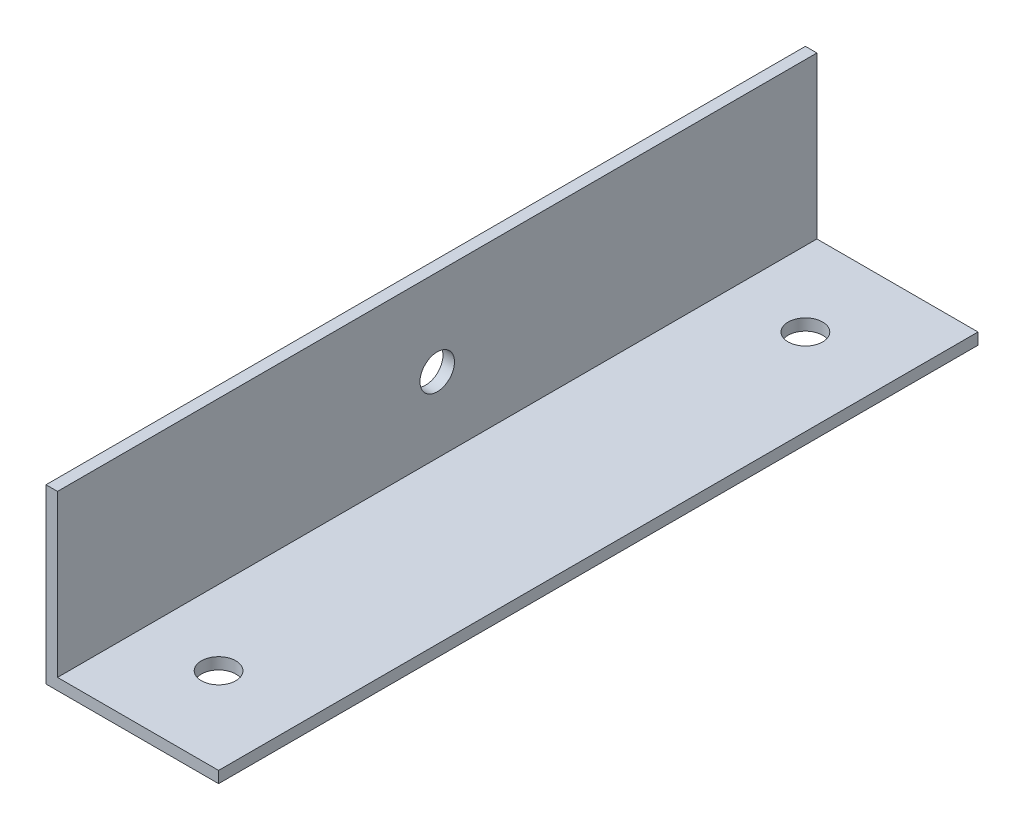
ISO-10303-21;
HEADER;
FILE_DESCRIPTION(('STEP AP214'),'2;1');
FILE_NAME('part.step','',(''),(''),'','','');
FILE_SCHEMA(('AUTOMOTIVE_DESIGN { 1 0 10303 214 1 1 1 1 }'));
ENDSEC;
DATA;
#1=APPLICATION_CONTEXT('core data for automotive mechanical design processes');
#2=APPLICATION_PROTOCOL_DEFINITION('international standard','automotive_design',2000,#1);
#3=PRODUCT_CONTEXT('',#1,'mechanical');
#4=PRODUCT('Part','Part','',(#3));
#5=PRODUCT_RELATED_PRODUCT_CATEGORY('part','',(#4));
#6=PRODUCT_DEFINITION_FORMATION('','',#4);
#7=PRODUCT_DEFINITION_CONTEXT('part definition',#1,'design');
#8=PRODUCT_DEFINITION('design','',#6,#7);
#9=PRODUCT_DEFINITION_SHAPE('','',#8);
#10=(LENGTH_UNIT() NAMED_UNIT(*) SI_UNIT(.MILLI.,.METRE.));
#11=(NAMED_UNIT(*) PLANE_ANGLE_UNIT() SI_UNIT($,.RADIAN.));
#12=(NAMED_UNIT(*) SI_UNIT($,.STERADIAN.) SOLID_ANGLE_UNIT());
#13=UNCERTAINTY_MEASURE_WITH_UNIT(LENGTH_MEASURE(1.E-05),#10,'distance_accuracy_value','');
#14=(GEOMETRIC_REPRESENTATION_CONTEXT(3) GLOBAL_UNCERTAINTY_ASSIGNED_CONTEXT((#13)) GLOBAL_UNIT_ASSIGNED_CONTEXT((#10,
#11,#12)) REPRESENTATION_CONTEXT('',''));
#15=CARTESIAN_POINT('',(0.,0.,0.));
#16=DIRECTION('',(0.,0.,1.));
#17=DIRECTION('',(1.,0.,0.));
#18=AXIS2_PLACEMENT_3D('',#15,#16,#17);
#19=CARTESIAN_POINT('',(-4.46145577395577,0.,66.));
#20=DIRECTION('',(1.,0.,0.));
#21=DIRECTION('',(0.,1.,0.));
#22=AXIS2_PLACEMENT_3D('',#19,#20,#21);
#23=PLANE('',#22);
#24=CARTESIAN_POINT('',(-4.46145577395577,-1.14669421487603,33.));
#25=DIRECTION('',(1.,0.,0.));
#26=DIRECTION('',(0.,1.,0.));
#27=AXIS2_PLACEMENT_3D('',#24,#25,#26);
#28=CIRCLE('',#27,1.5);
#29=CARTESIAN_POINT('',(-4.46145577395577,0.353305785123971,33.));
#30=VERTEX_POINT('',#29);
#31=EDGE_CURVE('E149',#30,#30,#28,.T.);
#32=ORIENTED_EDGE('',*,*,#31,.F.);
#33=EDGE_LOOP('',(#32));
#34=FACE_BOUND('',#33,.T.);
#35=DIRECTION('',(0.,-1.,0.));
#36=VECTOR('',#35,1.);
#37=CARTESIAN_POINT('',(-4.46145577395577,0.,0.));
#38=LINE('',#37,#36);
#39=CARTESIAN_POINT('',(-4.46145577395577,6.35330578512397,0.));
#40=VERTEX_POINT('',#39);
#41=CARTESIAN_POINT('',(-4.46145577395577,-7.64669421487603,0.));
#42=VERTEX_POINT('',#41);
#43=EDGE_CURVE('E118',#40,#42,#38,.T.);
#44=ORIENTED_EDGE('',*,*,#43,.F.);
#45=DIRECTION('',(0.,0.,-1.));
#46=VECTOR('',#45,1.);
#47=CARTESIAN_POINT('',(-4.46145577395577,6.35330578512397,66.));
#48=LINE('',#47,#46);
#49=CARTESIAN_POINT('',(-4.46145577395577,6.35330578512397,66.));
#50=VERTEX_POINT('',#49);
#51=EDGE_CURVE('E11',#50,#40,#48,.T.);
#52=ORIENTED_EDGE('',*,*,#51,.F.);
#53=DIRECTION('',(0.,-1.,0.));
#54=VECTOR('',#53,1.);
#55=CARTESIAN_POINT('',(-4.46145577395577,0.,66.));
#56=LINE('',#55,#54);
#57=CARTESIAN_POINT('',(-4.46145577395577,-7.64669421487603,66.));
#58=VERTEX_POINT('',#57);
#59=EDGE_CURVE('E131',#50,#58,#56,.T.);
#60=ORIENTED_EDGE('',*,*,#59,.T.);
#61=DIRECTION('',(0.,0.,-1.));
#62=VECTOR('',#61,1.);
#63=CARTESIAN_POINT('',(-4.46145577395577,-7.64669421487603,66.));
#64=LINE('',#63,#62);
#65=EDGE_CURVE('E80',#58,#42,#64,.T.);
#66=ORIENTED_EDGE('',*,*,#65,.T.);
#67=EDGE_LOOP('',(#44,#52,#60,#66));
#68=FACE_BOUND('',#67,.T.);
#69=ADVANCED_FACE('F35',(#34,#68),#23,.T.);
#70=CARTESIAN_POINT('',(0.,6.35330578512397,66.));
#71=DIRECTION('',(0.,1.,0.));
#72=DIRECTION('',(-1.,0.,0.));
#73=AXIS2_PLACEMENT_3D('',#70,#71,#72);
#74=PLANE('',#73);
#75=DIRECTION('',(1.,0.,0.));
#76=VECTOR('',#75,1.);
#77=CARTESIAN_POINT('',(0.,6.35330578512397,0.));
#78=LINE('',#77,#76);
#79=CARTESIAN_POINT('',(-5.46145577395577,6.35330578512397,0.));
#80=VERTEX_POINT('',#79);
#81=EDGE_CURVE('E121',#80,#40,#78,.T.);
#82=ORIENTED_EDGE('',*,*,#81,.F.);
#83=DIRECTION('',(0.,0.,-1.));
#84=VECTOR('',#83,1.);
#85=CARTESIAN_POINT('',(-5.46145577395577,6.35330578512397,66.));
#86=LINE('',#85,#84);
#87=CARTESIAN_POINT('',(-5.46145577395577,6.35330578512397,66.));
#88=VERTEX_POINT('',#87);
#89=EDGE_CURVE('E44',#88,#80,#86,.T.);
#90=ORIENTED_EDGE('',*,*,#89,.F.);
#91=DIRECTION('',(1.,0.,0.));
#92=VECTOR('',#91,1.);
#93=CARTESIAN_POINT('',(0.,6.35330578512397,66.));
#94=LINE('',#93,#92);
#95=EDGE_CURVE('E144',#88,#50,#94,.T.);
#96=ORIENTED_EDGE('',*,*,#95,.T.);
#97=ORIENTED_EDGE('',*,*,#51,.T.);
#98=EDGE_LOOP('',(#82,#90,#96,#97));
#99=FACE_BOUND('',#98,.T.);
#100=ADVANCED_FACE('F143',(#99),#74,.T.);
#101=CARTESIAN_POINT('',(-5.46145577395577,0.,66.));
#102=DIRECTION('',(1.,0.,0.));
#103=DIRECTION('',(0.,0.,-1.));
#104=AXIS2_PLACEMENT_3D('',#101,#102,#103);
#105=PLANE('',#104);
#106=CARTESIAN_POINT('',(-5.46145577395577,-1.14669421487603,33.));
#107=DIRECTION('',(1.,0.,0.));
#108=DIRECTION('',(0.,0.,-1.));
#109=AXIS2_PLACEMENT_3D('',#106,#107,#108);
#110=CIRCLE('',#109,1.5);
#111=CARTESIAN_POINT('',(-5.46145577395577,-1.14669421487603,31.5));
#112=VERTEX_POINT('',#111);
#113=EDGE_CURVE('E38',#112,#112,#110,.T.);
#114=ORIENTED_EDGE('',*,*,#113,.T.);
#115=EDGE_LOOP('',(#114));
#116=FACE_BOUND('',#115,.T.);
#117=DIRECTION('',(0.,-1.,0.));
#118=VECTOR('',#117,1.);
#119=CARTESIAN_POINT('',(-5.46145577395577,0.,0.));
#120=LINE('',#119,#118);
#121=CARTESIAN_POINT('',(-5.46145577395577,-8.64669421487603,0.));
#122=VERTEX_POINT('',#121);
#123=EDGE_CURVE('E124',#80,#122,#120,.T.);
#124=ORIENTED_EDGE('',*,*,#123,.T.);
#125=DIRECTION('',(0.,0.,-1.));
#126=VECTOR('',#125,1.);
#127=CARTESIAN_POINT('',(-5.46145577395577,-8.64669421487603,66.));
#128=LINE('',#127,#126);
#129=CARTESIAN_POINT('',(-5.46145577395577,-8.64669421487603,66.));
#130=VERTEX_POINT('',#129);
#131=EDGE_CURVE('E111',#130,#122,#128,.T.);
#132=ORIENTED_EDGE('',*,*,#131,.F.);
#133=DIRECTION('',(0.,-1.,0.));
#134=VECTOR('',#133,1.);
#135=CARTESIAN_POINT('',(-5.46145577395577,0.,66.));
#136=LINE('',#135,#134);
#137=EDGE_CURVE('E98',#88,#130,#136,.T.);
#138=ORIENTED_EDGE('',*,*,#137,.F.);
#139=ORIENTED_EDGE('',*,*,#89,.T.);
#140=EDGE_LOOP('',(#124,#132,#138,#139));
#141=FACE_BOUND('',#140,.T.);
#142=ADVANCED_FACE('F137',(#116,#141),#105,.F.);
#143=CARTESIAN_POINT('',(0.,-8.64669421487603,66.));
#144=DIRECTION('',(0.,1.,0.));
#145=DIRECTION('',(0.,0.,1.));
#146=AXIS2_PLACEMENT_3D('',#143,#144,#145);
#147=PLANE('',#146);
#148=CARTESIAN_POINT('',(2.03854422604423,-8.64669421487603,58.5));
#149=DIRECTION('',(0.,1.,0.));
#150=DIRECTION('',(0.,0.,1.));
#151=AXIS2_PLACEMENT_3D('',#148,#149,#150);
#152=CIRCLE('',#151,1.5);
#153=CARTESIAN_POINT('',(2.03854422604423,-8.64669421487603,60.));
#154=VERTEX_POINT('',#153);
#155=EDGE_CURVE('E158',#154,#154,#152,.T.);
#156=ORIENTED_EDGE('',*,*,#155,.T.);
#157=EDGE_LOOP('',(#156));
#158=FACE_BOUND('',#157,.T.);
#159=CARTESIAN_POINT('',(2.03854422604423,-8.64669421487603,7.5));
#160=DIRECTION('',(0.,1.,0.));
#161=DIRECTION('',(0.,0.,1.));
#162=AXIS2_PLACEMENT_3D('',#159,#160,#161);
#163=CIRCLE('',#162,1.5);
#164=CARTESIAN_POINT('',(2.03854422604423,-8.64669421487603,9.));
#165=VERTEX_POINT('',#164);
#166=EDGE_CURVE('E152',#165,#165,#163,.T.);
#167=ORIENTED_EDGE('',*,*,#166,.T.);
#168=EDGE_LOOP('',(#167));
#169=FACE_BOUND('',#168,.T.);
#170=DIRECTION('',(1.,0.,0.));
#171=VECTOR('',#170,1.);
#172=CARTESIAN_POINT('',(0.,-8.64669421487603,0.));
#173=LINE('',#172,#171);
#174=CARTESIAN_POINT('',(9.53854422604423,-8.64669421487603,0.));
#175=VERTEX_POINT('',#174);
#176=EDGE_CURVE('E107',#122,#175,#173,.T.);
#177=ORIENTED_EDGE('',*,*,#176,.T.);
#178=DIRECTION('',(0.,0.,-1.));
#179=VECTOR('',#178,1.);
#180=CARTESIAN_POINT('',(9.53854422604423,-8.64669421487603,66.));
#181=LINE('',#180,#179);
#182=CARTESIAN_POINT('',(9.53854422604423,-8.64669421487603,66.));
#183=VERTEX_POINT('',#182);
#184=EDGE_CURVE('E104',#183,#175,#181,.T.);
#185=ORIENTED_EDGE('',*,*,#184,.F.);
#186=DIRECTION('',(1.,0.,0.));
#187=VECTOR('',#186,1.);
#188=CARTESIAN_POINT('',(0.,-8.64669421487603,66.));
#189=LINE('',#188,#187);
#190=EDGE_CURVE('E91',#130,#183,#189,.T.);
#191=ORIENTED_EDGE('',*,*,#190,.F.);
#192=ORIENTED_EDGE('',*,*,#131,.T.);
#193=EDGE_LOOP('',(#177,#185,#191,#192));
#194=FACE_BOUND('',#193,.T.);
#195=ADVANCED_FACE('F105',(#158,#169,#194),#147,.F.);
#196=CARTESIAN_POINT('',(9.53854422604423,0.,66.));
#197=DIRECTION('',(1.,0.,0.));
#198=DIRECTION('',(0.,1.,0.));
#199=AXIS2_PLACEMENT_3D('',#196,#197,#198);
#200=PLANE('',#199);
#201=DIRECTION('',(0.,-1.,0.));
#202=VECTOR('',#201,1.);
#203=CARTESIAN_POINT('',(9.53854422604423,0.,0.));
#204=LINE('',#203,#202);
#205=CARTESIAN_POINT('',(9.53854422604423,-7.64669421487603,0.));
#206=VERTEX_POINT('',#205);
#207=EDGE_CURVE('E127',#206,#175,#204,.T.);
#208=ORIENTED_EDGE('',*,*,#207,.F.);
#209=DIRECTION('',(0.,0.,-1.));
#210=VECTOR('',#209,1.);
#211=CARTESIAN_POINT('',(9.53854422604423,-7.64669421487603,66.));
#212=LINE('',#211,#210);
#213=CARTESIAN_POINT('',(9.53854422604423,-7.64669421487603,66.));
#214=VERTEX_POINT('',#213);
#215=EDGE_CURVE('E73',#214,#206,#212,.T.);
#216=ORIENTED_EDGE('',*,*,#215,.F.);
#217=DIRECTION('',(0.,-1.,0.));
#218=VECTOR('',#217,1.);
#219=CARTESIAN_POINT('',(9.53854422604423,0.,66.));
#220=LINE('',#219,#218);
#221=EDGE_CURVE('E95',#214,#183,#220,.T.);
#222=ORIENTED_EDGE('',*,*,#221,.T.);
#223=ORIENTED_EDGE('',*,*,#184,.T.);
#224=EDGE_LOOP('',(#208,#216,#222,#223));
#225=FACE_BOUND('',#224,.T.);
#226=ADVANCED_FACE('F113',(#225),#200,.T.);
#227=CARTESIAN_POINT('',(0.,-7.64669421487603,66.));
#228=DIRECTION('',(0.,-1.,0.));
#229=DIRECTION('',(1.,0.,0.));
#230=AXIS2_PLACEMENT_3D('',#227,#228,#229);
#231=PLANE('',#230);
#232=CARTESIAN_POINT('',(2.03854422604423,-7.64669421487603,58.5));
#233=DIRECTION('',(0.,1.,0.));
#234=DIRECTION('',(-1.,0.,0.));
#235=AXIS2_PLACEMENT_3D('',#232,#233,#234);
#236=CIRCLE('',#235,1.5);
#237=CARTESIAN_POINT('',(0.538544226044231,-7.64669421487603,58.5));
#238=VERTEX_POINT('',#237);
#239=EDGE_CURVE('E161',#238,#238,#236,.T.);
#240=ORIENTED_EDGE('',*,*,#239,.F.);
#241=EDGE_LOOP('',(#240));
#242=FACE_BOUND('',#241,.T.);
#243=CARTESIAN_POINT('',(2.03854422604423,-7.64669421487603,7.5));
#244=DIRECTION('',(0.,1.,0.));
#245=DIRECTION('',(-1.,0.,0.));
#246=AXIS2_PLACEMENT_3D('',#243,#244,#245);
#247=CIRCLE('',#246,1.5);
#248=CARTESIAN_POINT('',(0.538544226044232,-7.64669421487603,7.5));
#249=VERTEX_POINT('',#248);
#250=EDGE_CURVE('E155',#249,#249,#247,.T.);
#251=ORIENTED_EDGE('',*,*,#250,.F.);
#252=EDGE_LOOP('',(#251));
#253=FACE_BOUND('',#252,.T.);
#254=DIRECTION('',(-1.,0.,0.));
#255=VECTOR('',#254,1.);
#256=CARTESIAN_POINT('',(0.,-7.64669421487603,0.));
#257=LINE('',#256,#255);
#258=EDGE_CURVE('E129',#206,#42,#257,.T.);
#259=ORIENTED_EDGE('',*,*,#258,.T.);
#260=ORIENTED_EDGE('',*,*,#65,.F.);
#261=DIRECTION('',(-1.,0.,0.));
#262=VECTOR('',#261,1.);
#263=CARTESIAN_POINT('',(0.,-7.64669421487603,66.));
#264=LINE('',#263,#262);
#265=EDGE_CURVE('E52',#214,#58,#264,.T.);
#266=ORIENTED_EDGE('',*,*,#265,.F.);
#267=ORIENTED_EDGE('',*,*,#215,.T.);
#268=EDGE_LOOP('',(#259,#260,#266,#267));
#269=FACE_BOUND('',#268,.T.);
#270=ADVANCED_FACE('F145',(#242,#253,#269),#231,.F.);
#271=CARTESIAN_POINT('',(0.,0.,66.));
#272=DIRECTION('',(0.,0.,1.));
#273=DIRECTION('',(1.,0.,0.));
#274=AXIS2_PLACEMENT_3D('',#271,#272,#273);
#275=PLANE('',#274);
#276=ORIENTED_EDGE('',*,*,#59,.F.);
#277=ORIENTED_EDGE('',*,*,#95,.F.);
#278=ORIENTED_EDGE('',*,*,#137,.T.);
#279=ORIENTED_EDGE('',*,*,#190,.T.);
#280=ORIENTED_EDGE('',*,*,#221,.F.);
#281=ORIENTED_EDGE('',*,*,#265,.T.);
#282=EDGE_LOOP('',(#276,#277,#278,#279,#280,#281));
#283=FACE_BOUND('',#282,.T.);
#284=ADVANCED_FACE('F93',(#283),#275,.T.);
#285=CARTESIAN_POINT('',(0.,0.,0.));
#286=DIRECTION('',(0.,0.,1.));
#287=DIRECTION('',(1.,0.,0.));
#288=AXIS2_PLACEMENT_3D('',#285,#286,#287);
#289=PLANE('',#288);
#290=ORIENTED_EDGE('',*,*,#43,.T.);
#291=ORIENTED_EDGE('',*,*,#258,.F.);
#292=ORIENTED_EDGE('',*,*,#207,.T.);
#293=ORIENTED_EDGE('',*,*,#176,.F.);
#294=ORIENTED_EDGE('',*,*,#123,.F.);
#295=ORIENTED_EDGE('',*,*,#81,.T.);
#296=EDGE_LOOP('',(#290,#291,#292,#293,#294,#295));
#297=FACE_BOUND('',#296,.T.);
#298=ADVANCED_FACE('F142',(#297),#289,.F.);
#299=CARTESIAN_POINT('',(-14.4614557739558,-1.14669421487603,33.));
#300=DIRECTION('',(1.,0.,0.));
#301=DIRECTION('',(0.,1.,0.));
#302=AXIS2_PLACEMENT_3D('',#299,#300,#301);
#303=CYLINDRICAL_SURFACE('',#302,1.5);
#304=ORIENTED_EDGE('',*,*,#31,.T.);
#305=EDGE_LOOP('',(#304));
#306=FACE_BOUND('',#305,.T.);
#307=ORIENTED_EDGE('',*,*,#113,.F.);
#308=EDGE_LOOP('',(#307));
#309=FACE_BOUND('',#308,.T.);
#310=ADVANCED_FACE('F176',(#306,#309),#303,.F.);
#311=CARTESIAN_POINT('',(2.03854422604423,-17.646694214876,7.5));
#312=DIRECTION('',(0.,1.,0.));
#313=DIRECTION('',(-1.,0.,0.));
#314=AXIS2_PLACEMENT_3D('',#311,#312,#313);
#315=CYLINDRICAL_SURFACE('',#314,1.5);
#316=ORIENTED_EDGE('',*,*,#250,.T.);
#317=EDGE_LOOP('',(#316));
#318=FACE_BOUND('',#317,.T.);
#319=ORIENTED_EDGE('',*,*,#166,.F.);
#320=EDGE_LOOP('',(#319));
#321=FACE_BOUND('',#320,.T.);
#322=ADVANCED_FACE('F173',(#318,#321),#315,.F.);
#323=CARTESIAN_POINT('',(2.03854422604423,-17.646694214876,58.5));
#324=DIRECTION('',(0.,1.,0.));
#325=DIRECTION('',(-1.,0.,0.));
#326=AXIS2_PLACEMENT_3D('',#323,#324,#325);
#327=CYLINDRICAL_SURFACE('',#326,1.5);
#328=ORIENTED_EDGE('',*,*,#239,.T.);
#329=EDGE_LOOP('',(#328));
#330=FACE_BOUND('',#329,.T.);
#331=ORIENTED_EDGE('',*,*,#155,.F.);
#332=EDGE_LOOP('',(#331));
#333=FACE_BOUND('',#332,.T.);
#334=ADVANCED_FACE('F165',(#330,#333),#327,.F.);
#335=CLOSED_SHELL('',(#69,#100,#142,#195,#226,#270,#284,#298,#310,#322,#334));
#336=MANIFOLD_SOLID_BREP('B2',#335);
#337=ADVANCED_BREP_SHAPE_REPRESENTATION('',(#18,#336),#14);
#338=SHAPE_DEFINITION_REPRESENTATION(#9,#337);
ENDSEC;
END-ISO-10303-21;
